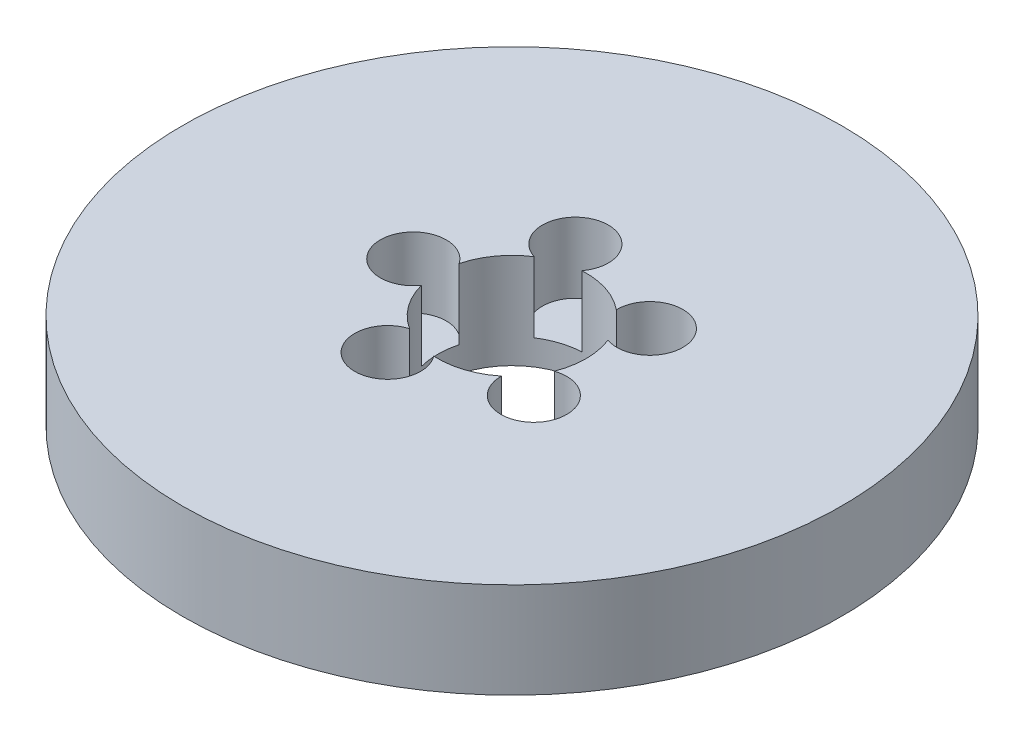
ISO-10303-21;
HEADER;
FILE_DESCRIPTION(('STEP AP214'),'2;1');
FILE_NAME('part.step','',(''),(''),'','','');
FILE_SCHEMA(('AUTOMOTIVE_DESIGN { 1 0 10303 214 1 1 1 1 }'));
ENDSEC;
DATA;
#1=APPLICATION_CONTEXT('core data for automotive mechanical design processes');
#2=APPLICATION_PROTOCOL_DEFINITION('international standard','automotive_design',2000,#1);
#3=PRODUCT_CONTEXT('',#1,'mechanical');
#4=PRODUCT('Part','Part','',(#3));
#5=PRODUCT_RELATED_PRODUCT_CATEGORY('part','',(#4));
#6=PRODUCT_DEFINITION_FORMATION('','',#4);
#7=PRODUCT_DEFINITION_CONTEXT('part definition',#1,'design');
#8=PRODUCT_DEFINITION('design','',#6,#7);
#9=PRODUCT_DEFINITION_SHAPE('','',#8);
#10=(LENGTH_UNIT() NAMED_UNIT(*) SI_UNIT(.MILLI.,.METRE.));
#11=(NAMED_UNIT(*) PLANE_ANGLE_UNIT() SI_UNIT($,.RADIAN.));
#12=(NAMED_UNIT(*) SI_UNIT($,.STERADIAN.) SOLID_ANGLE_UNIT());
#13=UNCERTAINTY_MEASURE_WITH_UNIT(LENGTH_MEASURE(1.E-05),#10,'distance_accuracy_value','');
#14=(GEOMETRIC_REPRESENTATION_CONTEXT(3) GLOBAL_UNCERTAINTY_ASSIGNED_CONTEXT((#13)) GLOBAL_UNIT_ASSIGNED_CONTEXT((#10,
#11,#12)) REPRESENTATION_CONTEXT('',''));
#15=CARTESIAN_POINT('',(0.,0.,0.));
#16=DIRECTION('',(0.,0.,1.));
#17=DIRECTION('',(1.,0.,0.));
#18=AXIS2_PLACEMENT_3D('',#15,#16,#17);
#19=CARTESIAN_POINT('',(0.,29.,0.));
#20=DIRECTION('',(0.,-1.,0.));
#21=DIRECTION('',(0.,0.,-1.));
#22=AXIS2_PLACEMENT_3D('',#19,#20,#21);
#23=CYLINDRICAL_SURFACE('',#22,100.);
#24=CARTESIAN_POINT('',(0.,29.,0.));
#25=DIRECTION('',(0.,1.,0.));
#26=DIRECTION('',(0.,0.,1.));
#27=AXIS2_PLACEMENT_3D('',#24,#25,#26);
#28=CIRCLE('',#27,100.);
#29=CARTESIAN_POINT('',(0.,29.,-100.));
#30=VERTEX_POINT('',#29);
#31=EDGE_CURVE('E157',#30,#30,#28,.T.);
#32=CARTESIAN_POINT('',(0.,0.,0.));
#33=DIRECTION('',(0.,1.,0.));
#34=DIRECTION('',(0.,0.,1.));
#35=AXIS2_PLACEMENT_3D('',#32,#33,#34);
#36=CIRCLE('',#35,100.);
#37=CARTESIAN_POINT('',(0.,0.,-100.));
#38=VERTEX_POINT('',#37);
#39=EDGE_CURVE('E150',#38,#38,#36,.T.);
#40=CARTESIAN_POINT('',(0.,29.,-100.));
#41=CARTESIAN_POINT('',(0.,28.6979166666667,-100.));
#42=CARTESIAN_POINT('',(0.,28.3958333333333,-100.));
#43=CARTESIAN_POINT('',(0.,27.7916666666667,-100.));
#44=CARTESIAN_POINT('',(0.,27.4895833333333,-100.));
#45=CARTESIAN_POINT('',(0.,26.8854166666667,-100.));
#46=CARTESIAN_POINT('',(0.,26.5833333333333,-100.));
#47=CARTESIAN_POINT('',(0.,25.9791666666667,-100.));
#48=CARTESIAN_POINT('',(0.,25.6770833333333,-100.));
#49=CARTESIAN_POINT('',(0.,25.0729166666667,-100.));
#50=CARTESIAN_POINT('',(0.,24.7708333333333,-100.));
#51=CARTESIAN_POINT('',(0.,24.1666666666667,-100.));
#52=CARTESIAN_POINT('',(0.,23.8645833333333,-100.));
#53=CARTESIAN_POINT('',(0.,23.2604166666667,-100.));
#54=CARTESIAN_POINT('',(0.,22.9583333333333,-100.));
#55=CARTESIAN_POINT('',(0.,22.3541666666667,-100.));
#56=CARTESIAN_POINT('',(0.,22.0520833333333,-100.));
#57=CARTESIAN_POINT('',(0.,21.4479166666667,-100.));
#58=CARTESIAN_POINT('',(0.,21.1458333333333,-100.));
#59=CARTESIAN_POINT('',(0.,20.5416666666667,-100.));
#60=CARTESIAN_POINT('',(0.,20.2395833333333,-100.));
#61=CARTESIAN_POINT('',(0.,19.6354166666667,-100.));
#62=CARTESIAN_POINT('',(0.,19.3333333333333,-100.));
#63=CARTESIAN_POINT('',(0.,18.7291666666667,-100.));
#64=CARTESIAN_POINT('',(0.,18.4270833333333,-100.));
#65=CARTESIAN_POINT('',(0.,17.8229166666667,-100.));
#66=CARTESIAN_POINT('',(0.,17.5208333333333,-100.));
#67=CARTESIAN_POINT('',(0.,16.9166666666667,-100.));
#68=CARTESIAN_POINT('',(0.,16.6145833333333,-100.));
#69=CARTESIAN_POINT('',(0.,16.0104166666667,-100.));
#70=CARTESIAN_POINT('',(0.,15.7083333333333,-100.));
#71=CARTESIAN_POINT('',(0.,15.1041666666667,-100.));
#72=CARTESIAN_POINT('',(0.,14.8020833333333,-100.));
#73=CARTESIAN_POINT('',(0.,14.1979166666667,-100.));
#74=CARTESIAN_POINT('',(0.,13.8958333333333,-100.));
#75=CARTESIAN_POINT('',(0.,13.2916666666667,-100.));
#76=CARTESIAN_POINT('',(0.,12.9895833333333,-100.));
#77=CARTESIAN_POINT('',(0.,12.3854166666667,-100.));
#78=CARTESIAN_POINT('',(0.,12.0833333333333,-100.));
#79=CARTESIAN_POINT('',(0.,11.4791666666667,-100.));
#80=CARTESIAN_POINT('',(0.,11.1770833333333,-100.));
#81=CARTESIAN_POINT('',(0.,10.5729166666667,-100.));
#82=CARTESIAN_POINT('',(0.,10.2708333333333,-100.));
#83=CARTESIAN_POINT('',(0.,9.66666666666667,-100.));
#84=CARTESIAN_POINT('',(0.,9.36458333333333,-100.));
#85=CARTESIAN_POINT('',(0.,8.76041666666667,-100.));
#86=CARTESIAN_POINT('',(0.,8.45833333333333,-100.));
#87=CARTESIAN_POINT('',(0.,7.85416666666667,-100.));
#88=CARTESIAN_POINT('',(0.,7.55208333333333,-100.));
#89=CARTESIAN_POINT('',(0.,6.94791666666667,-100.));
#90=CARTESIAN_POINT('',(0.,6.64583333333333,-100.));
#91=CARTESIAN_POINT('',(0.,6.04166666666667,-100.));
#92=CARTESIAN_POINT('',(0.,5.73958333333333,-100.));
#93=CARTESIAN_POINT('',(0.,5.13541666666667,-100.));
#94=CARTESIAN_POINT('',(0.,4.83333333333333,-100.));
#95=CARTESIAN_POINT('',(0.,4.22916666666667,-100.));
#96=CARTESIAN_POINT('',(0.,3.92708333333333,-100.));
#97=CARTESIAN_POINT('',(0.,3.32291666666667,-100.));
#98=CARTESIAN_POINT('',(0.,3.02083333333333,-100.));
#99=CARTESIAN_POINT('',(0.,2.41666666666667,-100.));
#100=CARTESIAN_POINT('',(0.,2.11458333333333,-100.));
#101=CARTESIAN_POINT('',(0.,1.51041666666667,-100.));
#102=CARTESIAN_POINT('',(0.,1.20833333333333,-100.));
#103=CARTESIAN_POINT('',(0.,0.604166666666667,-100.));
#104=CARTESIAN_POINT('',(0.,0.302083333333333,-100.));
#105=CARTESIAN_POINT('',(0.,0.,-100.));
#106=B_SPLINE_CURVE_WITH_KNOTS('',3,(#40,#41,#42,#43,#44,#45,#46,#47,#48,#49,#50,#51,#52,#53,
#54,#55,#56,#57,#58,#59,#60,#61,#62,#63,#64,#65,#66,#67,#68,#69,#70,#71,#72,#73,#74,#75,#76,#77,
#78,#79,#80,#81,#82,#83,#84,#85,#86,#87,#88,#89,#90,#91,#92,#93,#94,#95,#96,#97,#98,#99,#100,
#101,#102,#103,#104,#105),.UNSPECIFIED.,.F.,.F.,(4,2,2,2,2,2,2,2,2,2,2,2,2,2,2,2,2,2,2,2,2,2,2,
2,2,2,2,2,2,2,2,2,4),(0.,0.906249999999997,1.8125,2.71875,3.625,4.53125,5.4375,6.34375,7.25,
8.15625,9.0625,9.96875,10.875,11.78125,12.6875,13.59375,14.5,15.40625,16.3125,17.21875,18.125,
19.03125,19.9375,20.84375,21.75,22.65625,23.5625,24.46875,25.375,26.28125,27.1875,28.09375,29.),.UNSPECIFIED.);
#107=EDGE_CURVE('BSEAM39',#30,#38,#106,.T.);
#108=ORIENTED_EDGE('',*,*,#31,.F.);
#109=ORIENTED_EDGE('',*,*,#39,.T.);
#110=ORIENTED_EDGE('',*,*,#107,.T.);
#111=ORIENTED_EDGE('',*,*,#107,.F.);
#112=EDGE_LOOP('',(#108,#110,#109,#111));
#113=FACE_BOUND('',#112,.T.);
#114=ADVANCED_FACE('F39',(#113),#23,.T.);
#115=CARTESIAN_POINT('',(0.,29.,0.));
#116=DIRECTION('',(0.,1.,0.));
#117=DIRECTION('',(0.,0.,1.));
#118=AXIS2_PLACEMENT_3D('',#115,#116,#117);
#119=PLANE('',#118);
#120=CARTESIAN_POINT('',(-9.2552117519837,29.,-28.4846128421501));
#121=DIRECTION('',(0.,1.,0.));
#122=DIRECTION('',(-0.95105651629515,0.,0.309016994374958));
#123=AXIS2_PLACEMENT_3D('',#120,#121,#122);
#124=CIRCLE('',#123,10.);
#125=CARTESIAN_POINT('',(-1.27064296431739,29.,-22.4640928251561));
#126=VERTEX_POINT('',#125);
#127=CARTESIAN_POINT('',(-12.1760907168406,29.,-18.9206980541223));
#128=VERTEX_POINT('',#127);
#129=EDGE_CURVE('E194',#126,#128,#124,.T.);
#130=ORIENTED_EDGE('',*,*,#129,.F.);
#131=CARTESIAN_POINT('',(0.,29.,0.));
#132=DIRECTION('',(0.,1.,0.));
#133=DIRECTION('',(0.,0.,1.));
#134=AXIS2_PLACEMENT_3D('',#131,#132,#133);
#135=CIRCLE('',#134,22.5);
#136=CARTESIAN_POINT('',(14.2320342206713,29.,-17.426967663413));
#137=VERTEX_POINT('',#136);
#138=EDGE_CURVE('E147',#137,#126,#135,.T.);
#139=ORIENTED_EDGE('',*,*,#138,.F.);
#140=CARTESIAN_POINT('',(24.2304589397698,29.,-17.6044588928308));
#141=DIRECTION('',(0.,1.,0.));
#142=DIRECTION('',(-0.58778525229248,0.,-0.809016994374942));
#143=AXIS2_PLACEMENT_3D('',#140,#141,#142);
#144=CIRCLE('',#143,10.);
#145=CARTESIAN_POINT('',(20.9719715942669,29.,-8.15023971728816));
#146=VERTEX_POINT('',#145);
#147=EDGE_CURVE('E254',#146,#137,#144,.T.);
#148=ORIENTED_EDGE('',*,*,#147,.F.);
#149=CARTESIAN_POINT('',(20.971971594267,29.,8.15023971728786));
#150=VERTEX_POINT('',#149);
#151=EDGE_CURVE('E144',#150,#146,#135,.T.);
#152=ORIENTED_EDGE('',*,*,#151,.F.);
#153=CARTESIAN_POINT('',(24.2304589397701,29.,17.6044588928304));
#154=DIRECTION('',(0.,1.,0.));
#155=DIRECTION('',(0.587785252292469,0.,-0.809016994374951));
#156=AXIS2_PLACEMENT_3D('',#153,#154,#155);
#157=CIRCLE('',#156,10.);
#158=CARTESIAN_POINT('',(14.2320342206716,29.,17.4269676634128));
#159=VERTEX_POINT('',#158);
#160=EDGE_CURVE('E141',#159,#150,#157,.T.);
#161=ORIENTED_EDGE('',*,*,#160,.F.);
#162=CARTESIAN_POINT('',(-1.27064296431708,29.,22.4640928251561));
#163=VERTEX_POINT('',#162);
#164=EDGE_CURVE('E134',#163,#159,#135,.T.);
#165=ORIENTED_EDGE('',*,*,#164,.F.);
#166=CARTESIAN_POINT('',(-9.2552117519833,29.,28.4846128421502));
#167=DIRECTION('',(0.,1.,0.));
#168=DIRECTION('',(0.951056516295155,0.,0.309016994374945));
#169=AXIS2_PLACEMENT_3D('',#166,#167,#168);
#170=CIRCLE('',#169,10.);
#171=CARTESIAN_POINT('',(-12.1760907168404,29.,18.9206980541225));
#172=VERTEX_POINT('',#171);
#173=EDGE_CURVE('E111',#172,#163,#170,.T.);
#174=ORIENTED_EDGE('',*,*,#173,.F.);
#175=CARTESIAN_POINT('',(-21.7572721337809,29.,5.73333317509117));
#176=VERTEX_POINT('',#175);
#177=EDGE_CURVE('E145',#176,#172,#135,.T.);
#178=ORIENTED_EDGE('',*,*,#177,.F.);
#179=CARTESIAN_POINT('',(-29.9504943755731,29.,0.));
#180=DIRECTION('',(0.,1.,0.));
#181=DIRECTION('',(0.,0.,1.));
#182=AXIS2_PLACEMENT_3D('',#179,#180,#181);
#183=CIRCLE('',#182,10.);
#184=CARTESIAN_POINT('',(-21.7572721337809,29.,-5.73333317509117));
#185=VERTEX_POINT('',#184);
#186=EDGE_CURVE('E153',#185,#176,#183,.T.);
#187=ORIENTED_EDGE('',*,*,#186,.F.);
#188=EDGE_CURVE('E146',#128,#185,#135,.T.);
#189=ORIENTED_EDGE('',*,*,#188,.F.);
#190=EDGE_LOOP('',(#130,#139,#148,#152,#161,#165,#174,#178,#187,#189));
#191=FACE_BOUND('',#190,.T.);
#192=ORIENTED_EDGE('',*,*,#31,.T.);
#193=EDGE_LOOP('',(#192));
#194=FACE_BOUND('',#193,.T.);
#195=ADVANCED_FACE('F139',(#191,#194),#119,.T.);
#196=CARTESIAN_POINT('',(0.,0.,0.));
#197=DIRECTION('',(0.,1.,0.));
#198=DIRECTION('',(0.,0.,1.));
#199=AXIS2_PLACEMENT_3D('',#196,#197,#198);
#200=PLANE('',#199);
#201=CARTESIAN_POINT('',(0.,0.,0.));
#202=DIRECTION('',(0.,1.,0.));
#203=DIRECTION('',(0.,0.,1.));
#204=AXIS2_PLACEMENT_3D('',#201,#202,#203);
#205=CIRCLE('',#204,22.5);
#206=CARTESIAN_POINT('',(0.,0.,22.5));
#207=VERTEX_POINT('',#206);
#208=EDGE_CURVE('E154',#207,#207,#205,.T.);
#209=ORIENTED_EDGE('',*,*,#208,.T.);
#210=EDGE_LOOP('',(#209));
#211=FACE_BOUND('',#210,.T.);
#212=ORIENTED_EDGE('',*,*,#39,.F.);
#213=EDGE_LOOP('',(#212));
#214=FACE_BOUND('',#213,.T.);
#215=ADVANCED_FACE('F213',(#211,#214),#200,.F.);
#216=CARTESIAN_POINT('',(0.,29.,0.));
#217=DIRECTION('',(0.,-1.,0.));
#218=DIRECTION('',(0.,0.,-1.));
#219=AXIS2_PLACEMENT_3D('',#216,#217,#218);
#220=CYLINDRICAL_SURFACE('',#219,22.5);
#221=DIRECTION('',(0.,1.,0.));
#222=VECTOR('',#221,1.);
#223=CARTESIAN_POINT('',(-1.2706429643174,18.3391827812344,-22.4640928251561));
#224=LINE('',#223,#222);
#225=CARTESIAN_POINT('',(-1.27064296431739,7.67836556246873,-22.4640928251561));
#226=VERTEX_POINT('',#225);
#227=EDGE_CURVE('E11',#226,#126,#224,.T.);
#228=ORIENTED_EDGE('',*,*,#227,.F.);
#229=CARTESIAN_POINT('',(0.,7.67836556246873,0.));
#230=DIRECTION('',(0.,1.,0.));
#231=DIRECTION('',(0.,0.,1.));
#232=AXIS2_PLACEMENT_3D('',#229,#230,#231);
#233=CIRCLE('',#232,22.5);
#234=CARTESIAN_POINT('',(-12.1760907168406,7.67836556246873,-18.9206980541223));
#235=VERTEX_POINT('',#234);
#236=EDGE_CURVE('E189',#226,#235,#233,.T.);
#237=ORIENTED_EDGE('',*,*,#236,.T.);
#238=DIRECTION('',(0.,1.,0.));
#239=VECTOR('',#238,1.);
#240=CARTESIAN_POINT('',(-12.1760907168406,18.3391827812344,-18.9206980541223));
#241=LINE('',#240,#239);
#242=EDGE_CURVE('E46',#128,#235,#241,.F.);
#243=ORIENTED_EDGE('',*,*,#242,.F.);
#244=ORIENTED_EDGE('',*,*,#188,.T.);
#245=DIRECTION('',(0.,1.,0.));
#246=VECTOR('',#245,1.);
#247=CARTESIAN_POINT('',(-21.7572721337809,18.3391827812344,-5.73333317509117));
#248=LINE('',#247,#246);
#249=CARTESIAN_POINT('',(-21.7572721337809,7.67836556246873,-5.73333317509117));
#250=VERTEX_POINT('',#249);
#251=EDGE_CURVE('E168',#250,#185,#248,.T.);
#252=ORIENTED_EDGE('',*,*,#251,.F.);
#253=CARTESIAN_POINT('',(0.,7.67836556246873,0.));
#254=DIRECTION('',(0.,1.,0.));
#255=DIRECTION('',(0.,0.,1.));
#256=AXIS2_PLACEMENT_3D('',#253,#254,#255);
#257=CIRCLE('',#256,22.5);
#258=CARTESIAN_POINT('',(-21.7572721337809,7.67836556246873,5.73333317509117));
#259=VERTEX_POINT('',#258);
#260=EDGE_CURVE('E165',#250,#259,#257,.T.);
#261=ORIENTED_EDGE('',*,*,#260,.T.);
#262=DIRECTION('',(0.,1.,0.));
#263=VECTOR('',#262,1.);
#264=CARTESIAN_POINT('',(-21.7572721337809,18.3391827812344,5.73333317509117));
#265=LINE('',#264,#263);
#266=EDGE_CURVE('E170',#176,#259,#265,.F.);
#267=ORIENTED_EDGE('',*,*,#266,.F.);
#268=ORIENTED_EDGE('',*,*,#177,.T.);
#269=DIRECTION('',(0.,1.,0.));
#270=VECTOR('',#269,1.);
#271=CARTESIAN_POINT('',(-12.1760907168404,18.3391827812344,18.9206980541225));
#272=LINE('',#271,#270);
#273=CARTESIAN_POINT('',(-12.1760907168404,7.67836556246873,18.9206980541225));
#274=VERTEX_POINT('',#273);
#275=EDGE_CURVE('E121',#274,#172,#272,.T.);
#276=ORIENTED_EDGE('',*,*,#275,.F.);
#277=CARTESIAN_POINT('',(0.,7.67836556246873,0.));
#278=DIRECTION('',(0.,1.,0.));
#279=DIRECTION('',(0.,0.,1.));
#280=AXIS2_PLACEMENT_3D('',#277,#278,#279);
#281=CIRCLE('',#280,22.5);
#282=CARTESIAN_POINT('',(-1.27064296431708,7.67836556246873,22.4640928251561));
#283=VERTEX_POINT('',#282);
#284=EDGE_CURVE('E136',#274,#283,#281,.T.);
#285=ORIENTED_EDGE('',*,*,#284,.T.);
#286=DIRECTION('',(0.,1.,0.));
#287=VECTOR('',#286,1.);
#288=CARTESIAN_POINT('',(-1.27064296431708,18.3391827812344,22.4640928251561));
#289=LINE('',#288,#287);
#290=EDGE_CURVE('E117',#163,#283,#289,.F.);
#291=ORIENTED_EDGE('',*,*,#290,.F.);
#292=ORIENTED_EDGE('',*,*,#164,.T.);
#293=DIRECTION('',(0.,1.,0.));
#294=VECTOR('',#293,1.);
#295=CARTESIAN_POINT('',(14.2320342206716,18.3391827812344,17.4269676634127));
#296=LINE('',#295,#294);
#297=CARTESIAN_POINT('',(14.2320342206716,7.67836556246873,17.4269676634128));
#298=VERTEX_POINT('',#297);
#299=EDGE_CURVE('E182',#298,#159,#296,.T.);
#300=ORIENTED_EDGE('',*,*,#299,.F.);
#301=CARTESIAN_POINT('',(0.,7.67836556246873,0.));
#302=DIRECTION('',(0.,1.,0.));
#303=DIRECTION('',(0.,0.,1.));
#304=AXIS2_PLACEMENT_3D('',#301,#302,#303);
#305=CIRCLE('',#304,22.5);
#306=CARTESIAN_POINT('',(20.971971594267,7.67836556246873,8.15023971728786));
#307=VERTEX_POINT('',#306);
#308=EDGE_CURVE('E174',#298,#307,#305,.T.);
#309=ORIENTED_EDGE('',*,*,#308,.T.);
#310=DIRECTION('',(0.,1.,0.));
#311=VECTOR('',#310,1.);
#312=CARTESIAN_POINT('',(20.971971594267,18.3391827812344,8.15023971728786));
#313=LINE('',#312,#311);
#314=EDGE_CURVE('E177',#150,#307,#313,.F.);
#315=ORIENTED_EDGE('',*,*,#314,.F.);
#316=ORIENTED_EDGE('',*,*,#151,.T.);
#317=DIRECTION('',(0.,1.,0.));
#318=VECTOR('',#317,1.);
#319=CARTESIAN_POINT('',(20.9719715942669,18.3391827812344,-8.15023971728816));
#320=LINE('',#319,#318);
#321=CARTESIAN_POINT('',(20.9719715942669,7.67836556246873,-8.15023971728816));
#322=VERTEX_POINT('',#321);
#323=EDGE_CURVE('E187',#322,#146,#320,.T.);
#324=ORIENTED_EDGE('',*,*,#323,.F.);
#325=CARTESIAN_POINT('',(0.,7.67836556246873,0.));
#326=DIRECTION('',(0.,1.,0.));
#327=DIRECTION('',(0.,0.,1.));
#328=AXIS2_PLACEMENT_3D('',#325,#326,#327);
#329=CIRCLE('',#328,22.5);
#330=CARTESIAN_POINT('',(14.2320342206713,7.67836556246873,-17.426967663413));
#331=VERTEX_POINT('',#330);
#332=EDGE_CURVE('E181',#322,#331,#329,.T.);
#333=ORIENTED_EDGE('',*,*,#332,.T.);
#334=DIRECTION('',(0.,1.,0.));
#335=VECTOR('',#334,1.);
#336=CARTESIAN_POINT('',(14.2320342206713,18.3391827812344,-17.426967663413));
#337=LINE('',#336,#335);
#338=EDGE_CURVE('E186',#137,#331,#337,.F.);
#339=ORIENTED_EDGE('',*,*,#338,.F.);
#340=ORIENTED_EDGE('',*,*,#138,.T.);
#341=EDGE_LOOP('',(#228,#237,#243,#244,#252,#261,#267,#268,#276,#285,#291,#292,#300,#309,#315,
#316,#324,#333,#339,#340));
#342=FACE_BOUND('',#341,.T.);
#343=ORIENTED_EDGE('',*,*,#208,.F.);
#344=EDGE_LOOP('',(#343));
#345=FACE_BOUND('',#344,.T.);
#346=ADVANCED_FACE('F135',(#342,#345),#220,.F.);
#347=CARTESIAN_POINT('',(-29.9504943755731,7.67836556246873,0.));
#348=DIRECTION('',(0.,1.,0.));
#349=DIRECTION('',(0.,0.,1.));
#350=AXIS2_PLACEMENT_3D('',#347,#348,#349);
#351=CYLINDRICAL_SURFACE('',#350,10.);
#352=ORIENTED_EDGE('',*,*,#251,.T.);
#353=ORIENTED_EDGE('',*,*,#186,.T.);
#354=ORIENTED_EDGE('',*,*,#266,.T.);
#355=CARTESIAN_POINT('',(-29.9504943755731,7.67836556246873,0.));
#356=DIRECTION('',(0.,1.,0.));
#357=DIRECTION('',(0.,0.,1.));
#358=AXIS2_PLACEMENT_3D('',#355,#356,#357);
#359=CIRCLE('',#358,10.);
#360=EDGE_CURVE('E158',#250,#259,#359,.T.);
#361=ORIENTED_EDGE('',*,*,#360,.F.);
#362=EDGE_LOOP('',(#352,#353,#354,#361));
#363=FACE_BOUND('',#362,.T.);
#364=ADVANCED_FACE('F221',(#363),#351,.F.);
#365=CARTESIAN_POINT('',(-29.9504943755731,7.67836556246873,0.));
#366=DIRECTION('',(0.,1.,0.));
#367=DIRECTION('',(0.,0.,1.));
#368=AXIS2_PLACEMENT_3D('',#365,#366,#367);
#369=PLANE('',#368);
#370=ORIENTED_EDGE('',*,*,#360,.T.);
#371=ORIENTED_EDGE('',*,*,#260,.F.);
#372=EDGE_LOOP('',(#370,#371));
#373=FACE_BOUND('',#372,.T.);
#374=ADVANCED_FACE('F227',(#373),#369,.T.);
#375=CARTESIAN_POINT('',(-9.2552117519833,7.67836556246873,28.4846128421502));
#376=DIRECTION('',(0.,1.,0.));
#377=DIRECTION('',(0.,0.,1.));
#378=AXIS2_PLACEMENT_3D('',#375,#376,#377);
#379=CYLINDRICAL_SURFACE('',#378,10.);
#380=ORIENTED_EDGE('',*,*,#275,.T.);
#381=ORIENTED_EDGE('',*,*,#173,.T.);
#382=ORIENTED_EDGE('',*,*,#290,.T.);
#383=CARTESIAN_POINT('',(-9.2552117519833,7.67836556246873,28.4846128421502));
#384=DIRECTION('',(0.,1.,0.));
#385=DIRECTION('',(0.951056516295155,0.,0.309016994374945));
#386=AXIS2_PLACEMENT_3D('',#383,#384,#385);
#387=CIRCLE('',#386,10.);
#388=EDGE_CURVE('E127',#274,#283,#387,.T.);
#389=ORIENTED_EDGE('',*,*,#388,.F.);
#390=EDGE_LOOP('',(#380,#381,#382,#389));
#391=FACE_BOUND('',#390,.T.);
#392=ADVANCED_FACE('F116',(#391),#379,.F.);
#393=CARTESIAN_POINT('',(-9.2552117519833,7.67836556246873,28.4846128421502));
#394=DIRECTION('',(0.,1.,0.));
#395=DIRECTION('',(0.951056516295155,0.,0.309016994374945));
#396=AXIS2_PLACEMENT_3D('',#393,#394,#395);
#397=PLANE('',#396);
#398=ORIENTED_EDGE('',*,*,#388,.T.);
#399=ORIENTED_EDGE('',*,*,#284,.F.);
#400=EDGE_LOOP('',(#398,#399));
#401=FACE_BOUND('',#400,.T.);
#402=ADVANCED_FACE('F234',(#401),#397,.T.);
#403=CARTESIAN_POINT('',(24.2304589397701,7.67836556246873,17.6044588928304));
#404=DIRECTION('',(0.,1.,0.));
#405=DIRECTION('',(0.,0.,1.));
#406=AXIS2_PLACEMENT_3D('',#403,#404,#405);
#407=CYLINDRICAL_SURFACE('',#406,10.);
#408=ORIENTED_EDGE('',*,*,#299,.T.);
#409=ORIENTED_EDGE('',*,*,#160,.T.);
#410=ORIENTED_EDGE('',*,*,#314,.T.);
#411=CARTESIAN_POINT('',(24.2304589397701,7.67836556246873,17.6044588928304));
#412=DIRECTION('',(0.,1.,0.));
#413=DIRECTION('',(0.587785252292469,0.,-0.809016994374951));
#414=AXIS2_PLACEMENT_3D('',#411,#412,#413);
#415=CIRCLE('',#414,10.);
#416=EDGE_CURVE('E130',#298,#307,#415,.T.);
#417=ORIENTED_EDGE('',*,*,#416,.F.);
#418=EDGE_LOOP('',(#408,#409,#410,#417));
#419=FACE_BOUND('',#418,.T.);
#420=ADVANCED_FACE('F240',(#419),#407,.F.);
#421=CARTESIAN_POINT('',(24.2304589397701,7.67836556246873,17.6044588928304));
#422=DIRECTION('',(0.,1.,0.));
#423=DIRECTION('',(0.587785252292469,0.,-0.809016994374951));
#424=AXIS2_PLACEMENT_3D('',#421,#422,#423);
#425=PLANE('',#424);
#426=ORIENTED_EDGE('',*,*,#416,.T.);
#427=ORIENTED_EDGE('',*,*,#308,.F.);
#428=EDGE_LOOP('',(#426,#427));
#429=FACE_BOUND('',#428,.T.);
#430=ADVANCED_FACE('F245',(#429),#425,.T.);
#431=CARTESIAN_POINT('',(24.2304589397698,7.67836556246873,-17.6044588928308));
#432=DIRECTION('',(0.,1.,0.));
#433=DIRECTION('',(0.,0.,1.));
#434=AXIS2_PLACEMENT_3D('',#431,#432,#433);
#435=CYLINDRICAL_SURFACE('',#434,10.);
#436=ORIENTED_EDGE('',*,*,#323,.T.);
#437=ORIENTED_EDGE('',*,*,#147,.T.);
#438=ORIENTED_EDGE('',*,*,#338,.T.);
#439=CARTESIAN_POINT('',(24.2304589397698,7.67836556246873,-17.6044588928308));
#440=DIRECTION('',(0.,1.,0.));
#441=DIRECTION('',(-0.58778525229248,0.,-0.809016994374942));
#442=AXIS2_PLACEMENT_3D('',#439,#440,#441);
#443=CIRCLE('',#442,10.);
#444=EDGE_CURVE('E56',#322,#331,#443,.T.);
#445=ORIENTED_EDGE('',*,*,#444,.F.);
#446=EDGE_LOOP('',(#436,#437,#438,#445));
#447=FACE_BOUND('',#446,.T.);
#448=ADVANCED_FACE('F266',(#447),#435,.F.);
#449=CARTESIAN_POINT('',(24.2304589397698,7.67836556246873,-17.6044588928308));
#450=DIRECTION('',(0.,1.,0.));
#451=DIRECTION('',(-0.58778525229248,0.,-0.809016994374942));
#452=AXIS2_PLACEMENT_3D('',#449,#450,#451);
#453=PLANE('',#452);
#454=ORIENTED_EDGE('',*,*,#444,.T.);
#455=ORIENTED_EDGE('',*,*,#332,.F.);
#456=EDGE_LOOP('',(#454,#455));
#457=FACE_BOUND('',#456,.T.);
#458=ADVANCED_FACE('F204',(#457),#453,.T.);
#459=CARTESIAN_POINT('',(-9.2552117519837,7.67836556246873,-28.4846128421501));
#460=DIRECTION('',(0.,1.,0.));
#461=DIRECTION('',(0.,0.,1.));
#462=AXIS2_PLACEMENT_3D('',#459,#460,#461);
#463=CYLINDRICAL_SURFACE('',#462,10.);
#464=ORIENTED_EDGE('',*,*,#227,.T.);
#465=ORIENTED_EDGE('',*,*,#129,.T.);
#466=ORIENTED_EDGE('',*,*,#242,.T.);
#467=CARTESIAN_POINT('',(-9.2552117519837,7.67836556246873,-28.4846128421501));
#468=DIRECTION('',(0.,1.,0.));
#469=DIRECTION('',(-0.95105651629515,0.,0.309016994374958));
#470=AXIS2_PLACEMENT_3D('',#467,#468,#469);
#471=CIRCLE('',#470,10.);
#472=EDGE_CURVE('E55',#226,#235,#471,.T.);
#473=ORIENTED_EDGE('',*,*,#472,.F.);
#474=EDGE_LOOP('',(#464,#465,#466,#473));
#475=FACE_BOUND('',#474,.T.);
#476=ADVANCED_FACE('F193',(#475),#463,.F.);
#477=CARTESIAN_POINT('',(-9.2552117519837,7.67836556246873,-28.4846128421501));
#478=DIRECTION('',(0.,1.,0.));
#479=DIRECTION('',(-0.95105651629515,0.,0.309016994374958));
#480=AXIS2_PLACEMENT_3D('',#477,#478,#479);
#481=PLANE('',#480);
#482=ORIENTED_EDGE('',*,*,#472,.T.);
#483=ORIENTED_EDGE('',*,*,#236,.F.);
#484=EDGE_LOOP('',(#482,#483));
#485=FACE_BOUND('',#484,.T.);
#486=ADVANCED_FACE('F196',(#485),#481,.T.);
#487=CLOSED_SHELL('',(#114,#195,#215,#346,#364,#374,#392,#402,#420,#430,#448,#458,#476,#486));
#488=MANIFOLD_SOLID_BREP('B2',#487);
#489=ADVANCED_BREP_SHAPE_REPRESENTATION('',(#18,#488),#14);
#490=SHAPE_DEFINITION_REPRESENTATION(#9,#489);
ENDSEC;
END-ISO-10303-21;
